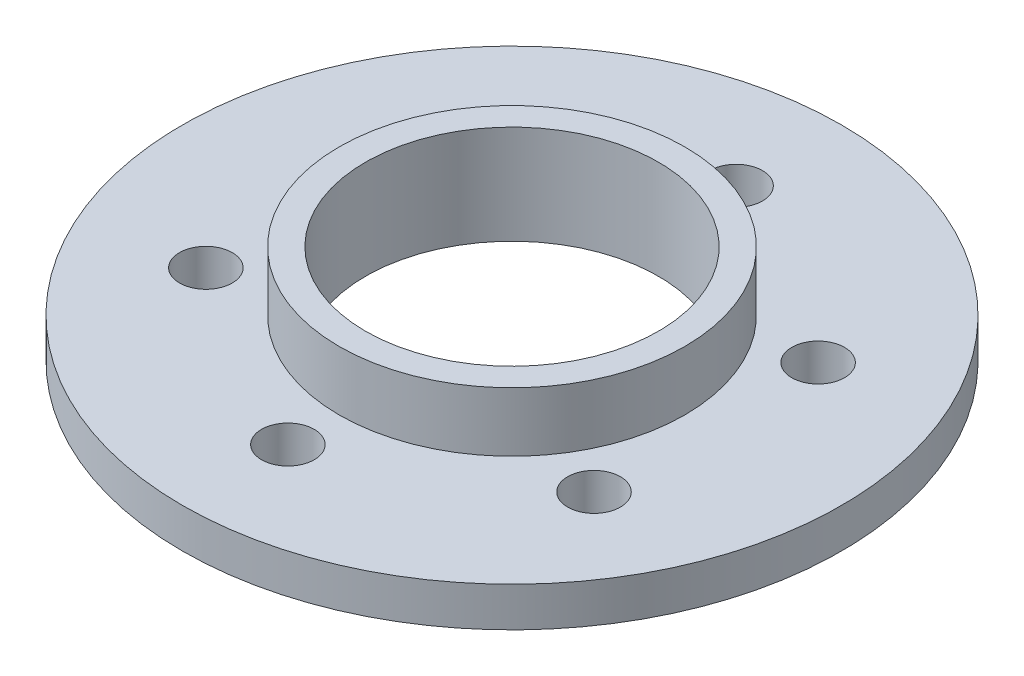
ISO-10303-21;
HEADER;
FILE_DESCRIPTION(('STEP AP214'),'2;1');
FILE_NAME('part.step','',(''),(''),'','','');
FILE_SCHEMA(('AUTOMOTIVE_DESIGN { 1 0 10303 214 1 1 1 1 }'));
ENDSEC;
DATA;
#1=APPLICATION_CONTEXT('core data for automotive mechanical design processes');
#2=APPLICATION_PROTOCOL_DEFINITION('international standard','automotive_design',2000,#1);
#3=PRODUCT_CONTEXT('',#1,'mechanical');
#4=PRODUCT('Part','Part','',(#3));
#5=PRODUCT_RELATED_PRODUCT_CATEGORY('part','',(#4));
#6=PRODUCT_DEFINITION_FORMATION('','',#4);
#7=PRODUCT_DEFINITION_CONTEXT('part definition',#1,'design');
#8=PRODUCT_DEFINITION('design','',#6,#7);
#9=PRODUCT_DEFINITION_SHAPE('','',#8);
#10=(LENGTH_UNIT() NAMED_UNIT(*) SI_UNIT(.MILLI.,.METRE.));
#11=(NAMED_UNIT(*) PLANE_ANGLE_UNIT() SI_UNIT($,.RADIAN.));
#12=(NAMED_UNIT(*) SI_UNIT($,.STERADIAN.) SOLID_ANGLE_UNIT());
#13=UNCERTAINTY_MEASURE_WITH_UNIT(LENGTH_MEASURE(1.E-05),#10,'distance_accuracy_value','');
#14=(GEOMETRIC_REPRESENTATION_CONTEXT(3) GLOBAL_UNCERTAINTY_ASSIGNED_CONTEXT((#13)) GLOBAL_UNIT_ASSIGNED_CONTEXT((#10,
#11,#12)) REPRESENTATION_CONTEXT('',''));
#15=CARTESIAN_POINT('',(0.,0.,0.));
#16=DIRECTION('',(0.,0.,1.));
#17=DIRECTION('',(1.,0.,0.));
#18=AXIS2_PLACEMENT_3D('',#15,#16,#17);
#19=CARTESIAN_POINT('',(0.,3.,0.));
#20=DIRECTION('',(0.,1.,0.));
#21=DIRECTION('',(0.,0.,1.));
#22=AXIS2_PLACEMENT_3D('',#19,#20,#21);
#23=PLANE('',#22);
#24=CARTESIAN_POINT('',(0.,3.,0.));
#25=DIRECTION('',(0.,1.,0.));
#26=DIRECTION('',(0.,0.,1.));
#27=AXIS2_PLACEMENT_3D('',#24,#25,#26);
#28=CIRCLE('',#27,13.1125);
#29=CARTESIAN_POINT('',(0.,3.,13.1125));
#30=VERTEX_POINT('',#29);
#31=EDGE_CURVE('E84',#30,#30,#28,.T.);
#32=ORIENTED_EDGE('',*,*,#31,.F.);
#33=EDGE_LOOP('',(#32));
#34=FACE_BOUND('',#33,.T.);
#35=CARTESIAN_POINT('',(0.,3.,-17.));
#36=DIRECTION('',(0.,1.,0.));
#37=DIRECTION('',(0.,0.,1.));
#38=AXIS2_PLACEMENT_3D('',#35,#36,#37);
#39=CIRCLE('',#38,2.);
#40=CARTESIAN_POINT('',(0.,3.,-15.));
#41=VERTEX_POINT('',#40);
#42=EDGE_CURVE('E73',#41,#41,#39,.T.);
#43=ORIENTED_EDGE('',*,*,#42,.F.);
#44=EDGE_LOOP('',(#43));
#45=FACE_BOUND('',#44,.T.);
#46=CARTESIAN_POINT('',(-14.7224318643355,3.,-8.49999999999999));
#47=DIRECTION('',(0.,1.,0.));
#48=DIRECTION('',(0.,0.,1.));
#49=AXIS2_PLACEMENT_3D('',#46,#47,#48);
#50=CIRCLE('',#49,2.0000000000002);
#51=CARTESIAN_POINT('',(-14.7224318643355,3.,-6.49999999999979));
#52=VERTEX_POINT('',#51);
#53=EDGE_CURVE('E74',#52,#52,#50,.T.);
#54=ORIENTED_EDGE('',*,*,#53,.F.);
#55=EDGE_LOOP('',(#54));
#56=FACE_BOUND('',#55,.T.);
#57=CARTESIAN_POINT('',(-14.7224318643355,3.,8.5));
#58=DIRECTION('',(0.,1.,0.));
#59=DIRECTION('',(0.,0.,1.));
#60=AXIS2_PLACEMENT_3D('',#57,#58,#59);
#61=CIRCLE('',#60,2.00000000000015);
#62=CARTESIAN_POINT('',(-14.7224318643355,3.,10.5000000000002));
#63=VERTEX_POINT('',#62);
#64=EDGE_CURVE('E48',#63,#63,#61,.T.);
#65=ORIENTED_EDGE('',*,*,#64,.F.);
#66=EDGE_LOOP('',(#65));
#67=FACE_BOUND('',#66,.T.);
#68=CARTESIAN_POINT('',(0.,3.,17.));
#69=DIRECTION('',(0.,1.,0.));
#70=DIRECTION('',(0.,0.,1.));
#71=AXIS2_PLACEMENT_3D('',#68,#69,#70);
#72=CIRCLE('',#71,2.00000000000012);
#73=CARTESIAN_POINT('',(0.,3.,19.0000000000001));
#74=VERTEX_POINT('',#73);
#75=EDGE_CURVE('E55',#74,#74,#72,.T.);
#76=ORIENTED_EDGE('',*,*,#75,.F.);
#77=EDGE_LOOP('',(#76));
#78=FACE_BOUND('',#77,.T.);
#79=CARTESIAN_POINT('',(14.7224318643355,3.,8.5));
#80=DIRECTION('',(0.,1.,0.));
#81=DIRECTION('',(0.,0.,1.));
#82=AXIS2_PLACEMENT_3D('',#79,#80,#81);
#83=CIRCLE('',#82,2.00000000000008);
#84=CARTESIAN_POINT('',(14.7224318643355,3.,10.5000000000001));
#85=VERTEX_POINT('',#84);
#86=EDGE_CURVE('E61',#85,#85,#83,.T.);
#87=ORIENTED_EDGE('',*,*,#86,.F.);
#88=EDGE_LOOP('',(#87));
#89=FACE_BOUND('',#88,.T.);
#90=CARTESIAN_POINT('',(14.7224318643355,3.,-8.50000000000001));
#91=DIRECTION('',(0.,1.,0.));
#92=DIRECTION('',(0.,0.,1.));
#93=AXIS2_PLACEMENT_3D('',#90,#91,#92);
#94=CIRCLE('',#93,2.00000000000004);
#95=CARTESIAN_POINT('',(14.7224318643355,3.,-6.49999999999996));
#96=VERTEX_POINT('',#95);
#97=EDGE_CURVE('E67',#96,#96,#94,.T.);
#98=ORIENTED_EDGE('',*,*,#97,.F.);
#99=EDGE_LOOP('',(#98));
#100=FACE_BOUND('',#99,.T.);
#101=CARTESIAN_POINT('',(0.,3.,0.));
#102=DIRECTION('',(0.,1.,0.));
#103=DIRECTION('',(0.,0.,1.));
#104=AXIS2_PLACEMENT_3D('',#101,#102,#103);
#105=CIRCLE('',#104,25.);
#106=CARTESIAN_POINT('',(0.,3.,25.));
#107=VERTEX_POINT('',#106);
#108=EDGE_CURVE('E10',#107,#107,#105,.T.);
#109=ORIENTED_EDGE('',*,*,#108,.T.);
#110=EDGE_LOOP('',(#109));
#111=FACE_BOUND('',#110,.T.);
#112=ADVANCED_FACE('F35',(#34,#45,#56,#67,#78,#89,#100,#111),#23,.T.);
#113=CARTESIAN_POINT('',(0.,0.,0.));
#114=DIRECTION('',(0.,1.,0.));
#115=DIRECTION('',(0.,0.,1.));
#116=AXIS2_PLACEMENT_3D('',#113,#114,#115);
#117=PLANE('',#116);
#118=CARTESIAN_POINT('',(0.,0.,0.));
#119=DIRECTION('',(0.,1.,0.));
#120=DIRECTION('',(0.,0.,1.));
#121=AXIS2_PLACEMENT_3D('',#118,#119,#120);
#122=CIRCLE('',#121,11.1125);
#123=CARTESIAN_POINT('',(0.,0.,11.1125));
#124=VERTEX_POINT('',#123);
#125=EDGE_CURVE('E92',#124,#124,#122,.T.);
#126=ORIENTED_EDGE('',*,*,#125,.T.);
#127=EDGE_LOOP('',(#126));
#128=FACE_BOUND('',#127,.T.);
#129=CARTESIAN_POINT('',(0.,0.,-17.));
#130=DIRECTION('',(0.,1.,0.));
#131=DIRECTION('',(0.,0.,1.));
#132=AXIS2_PLACEMENT_3D('',#129,#130,#131);
#133=CIRCLE('',#132,2.);
#134=CARTESIAN_POINT('',(0.,0.,-15.));
#135=VERTEX_POINT('',#134);
#136=EDGE_CURVE('E46',#135,#135,#133,.T.);
#137=ORIENTED_EDGE('',*,*,#136,.T.);
#138=EDGE_LOOP('',(#137));
#139=FACE_BOUND('',#138,.T.);
#140=CARTESIAN_POINT('',(-14.7224318643355,0.,-8.49999999999999));
#141=DIRECTION('',(0.,1.,0.));
#142=DIRECTION('',(0.,0.,1.));
#143=AXIS2_PLACEMENT_3D('',#140,#141,#142);
#144=CIRCLE('',#143,2.0000000000002);
#145=CARTESIAN_POINT('',(-14.7224318643355,0.,-6.49999999999979));
#146=VERTEX_POINT('',#145);
#147=EDGE_CURVE('E52',#146,#146,#144,.T.);
#148=ORIENTED_EDGE('',*,*,#147,.T.);
#149=EDGE_LOOP('',(#148));
#150=FACE_BOUND('',#149,.T.);
#151=CARTESIAN_POINT('',(-14.7224318643355,0.,8.5));
#152=DIRECTION('',(0.,1.,0.));
#153=DIRECTION('',(0.,0.,1.));
#154=AXIS2_PLACEMENT_3D('',#151,#152,#153);
#155=CIRCLE('',#154,2.00000000000015);
#156=CARTESIAN_POINT('',(-14.7224318643355,0.,10.5000000000002));
#157=VERTEX_POINT('',#156);
#158=EDGE_CURVE('E51',#157,#157,#155,.T.);
#159=ORIENTED_EDGE('',*,*,#158,.T.);
#160=EDGE_LOOP('',(#159));
#161=FACE_BOUND('',#160,.T.);
#162=CARTESIAN_POINT('',(0.,0.,17.));
#163=DIRECTION('',(0.,1.,0.));
#164=DIRECTION('',(0.,0.,1.));
#165=AXIS2_PLACEMENT_3D('',#162,#163,#164);
#166=CIRCLE('',#165,2.00000000000012);
#167=CARTESIAN_POINT('',(0.,0.,19.0000000000001));
#168=VERTEX_POINT('',#167);
#169=EDGE_CURVE('E58',#168,#168,#166,.T.);
#170=ORIENTED_EDGE('',*,*,#169,.T.);
#171=EDGE_LOOP('',(#170));
#172=FACE_BOUND('',#171,.T.);
#173=CARTESIAN_POINT('',(14.7224318643355,0.,8.5));
#174=DIRECTION('',(0.,1.,0.));
#175=DIRECTION('',(0.,0.,1.));
#176=AXIS2_PLACEMENT_3D('',#173,#174,#175);
#177=CIRCLE('',#176,2.00000000000008);
#178=CARTESIAN_POINT('',(14.7224318643355,0.,10.5000000000001));
#179=VERTEX_POINT('',#178);
#180=EDGE_CURVE('E64',#179,#179,#177,.T.);
#181=ORIENTED_EDGE('',*,*,#180,.T.);
#182=EDGE_LOOP('',(#181));
#183=FACE_BOUND('',#182,.T.);
#184=CARTESIAN_POINT('',(14.7224318643355,0.,-8.50000000000001));
#185=DIRECTION('',(0.,1.,0.));
#186=DIRECTION('',(0.,0.,1.));
#187=AXIS2_PLACEMENT_3D('',#184,#185,#186);
#188=CIRCLE('',#187,2.00000000000004);
#189=CARTESIAN_POINT('',(14.7224318643355,0.,-6.49999999999996));
#190=VERTEX_POINT('',#189);
#191=EDGE_CURVE('E70',#190,#190,#188,.T.);
#192=ORIENTED_EDGE('',*,*,#191,.T.);
#193=EDGE_LOOP('',(#192));
#194=FACE_BOUND('',#193,.T.);
#195=CARTESIAN_POINT('',(0.,0.,0.));
#196=DIRECTION('',(0.,1.,0.));
#197=DIRECTION('',(0.,0.,1.));
#198=AXIS2_PLACEMENT_3D('',#195,#196,#197);
#199=CIRCLE('',#198,25.);
#200=CARTESIAN_POINT('',(0.,0.,25.));
#201=VERTEX_POINT('',#200);
#202=EDGE_CURVE('E39',#201,#201,#199,.T.);
#203=ORIENTED_EDGE('',*,*,#202,.F.);
#204=EDGE_LOOP('',(#203));
#205=FACE_BOUND('',#204,.T.);
#206=ADVANCED_FACE('F96',(#128,#139,#150,#161,#172,#183,#194,#205),#117,.F.);
#207=CARTESIAN_POINT('',(0.,3.,0.));
#208=DIRECTION('',(0.,-1.,0.));
#209=DIRECTION('',(0.,0.,-1.));
#210=AXIS2_PLACEMENT_3D('',#207,#208,#209);
#211=CYLINDRICAL_SURFACE('',#210,25.);
#212=ORIENTED_EDGE('',*,*,#108,.F.);
#213=EDGE_LOOP('',(#212));
#214=FACE_BOUND('',#213,.T.);
#215=ORIENTED_EDGE('',*,*,#202,.T.);
#216=EDGE_LOOP('',(#215));
#217=FACE_BOUND('',#216,.T.);
#218=ADVANCED_FACE('F37',(#214,#217),#211,.T.);
#219=CARTESIAN_POINT('',(14.7224318643355,0.,-8.50000000000001));
#220=DIRECTION('',(0.,1.,0.));
#221=DIRECTION('',(0.,0.,1.));
#222=AXIS2_PLACEMENT_3D('',#219,#220,#221);
#223=CYLINDRICAL_SURFACE('',#222,2.00000000000004);
#224=ORIENTED_EDGE('',*,*,#191,.F.);
#225=EDGE_LOOP('',(#224));
#226=FACE_BOUND('',#225,.T.);
#227=ORIENTED_EDGE('',*,*,#97,.T.);
#228=EDGE_LOOP('',(#227));
#229=FACE_BOUND('',#228,.T.);
#230=ADVANCED_FACE('F132',(#226,#229),#223,.F.);
#231=CARTESIAN_POINT('',(14.7224318643355,0.,8.5));
#232=DIRECTION('',(0.,1.,0.));
#233=DIRECTION('',(0.,0.,1.));
#234=AXIS2_PLACEMENT_3D('',#231,#232,#233);
#235=CYLINDRICAL_SURFACE('',#234,2.00000000000008);
#236=ORIENTED_EDGE('',*,*,#180,.F.);
#237=EDGE_LOOP('',(#236));
#238=FACE_BOUND('',#237,.T.);
#239=ORIENTED_EDGE('',*,*,#86,.T.);
#240=EDGE_LOOP('',(#239));
#241=FACE_BOUND('',#240,.T.);
#242=ADVANCED_FACE('F128',(#238,#241),#235,.F.);
#243=CARTESIAN_POINT('',(0.,0.,17.));
#244=DIRECTION('',(0.,1.,0.));
#245=DIRECTION('',(0.,0.,1.));
#246=AXIS2_PLACEMENT_3D('',#243,#244,#245);
#247=CYLINDRICAL_SURFACE('',#246,2.00000000000012);
#248=ORIENTED_EDGE('',*,*,#169,.F.);
#249=EDGE_LOOP('',(#248));
#250=FACE_BOUND('',#249,.T.);
#251=ORIENTED_EDGE('',*,*,#75,.T.);
#252=EDGE_LOOP('',(#251));
#253=FACE_BOUND('',#252,.T.);
#254=ADVANCED_FACE('F124',(#250,#253),#247,.F.);
#255=CARTESIAN_POINT('',(-14.7224318643355,0.,8.5));
#256=DIRECTION('',(0.,1.,0.));
#257=DIRECTION('',(0.,0.,1.));
#258=AXIS2_PLACEMENT_3D('',#255,#256,#257);
#259=CYLINDRICAL_SURFACE('',#258,2.00000000000015);
#260=ORIENTED_EDGE('',*,*,#158,.F.);
#261=EDGE_LOOP('',(#260));
#262=FACE_BOUND('',#261,.T.);
#263=ORIENTED_EDGE('',*,*,#64,.T.);
#264=EDGE_LOOP('',(#263));
#265=FACE_BOUND('',#264,.T.);
#266=ADVANCED_FACE('F120',(#262,#265),#259,.F.);
#267=CARTESIAN_POINT('',(-14.7224318643355,0.,-8.49999999999999));
#268=DIRECTION('',(0.,1.,0.));
#269=DIRECTION('',(0.,0.,1.));
#270=AXIS2_PLACEMENT_3D('',#267,#268,#269);
#271=CYLINDRICAL_SURFACE('',#270,2.0000000000002);
#272=ORIENTED_EDGE('',*,*,#147,.F.);
#273=EDGE_LOOP('',(#272));
#274=FACE_BOUND('',#273,.T.);
#275=ORIENTED_EDGE('',*,*,#53,.T.);
#276=EDGE_LOOP('',(#275));
#277=FACE_BOUND('',#276,.T.);
#278=ADVANCED_FACE('F123',(#274,#277),#271,.F.);
#279=CARTESIAN_POINT('',(0.,0.,-17.));
#280=DIRECTION('',(0.,1.,0.));
#281=DIRECTION('',(0.,0.,1.));
#282=AXIS2_PLACEMENT_3D('',#279,#280,#281);
#283=CYLINDRICAL_SURFACE('',#282,2.);
#284=ORIENTED_EDGE('',*,*,#136,.F.);
#285=EDGE_LOOP('',(#284));
#286=FACE_BOUND('',#285,.T.);
#287=ORIENTED_EDGE('',*,*,#42,.T.);
#288=EDGE_LOOP('',(#287));
#289=FACE_BOUND('',#288,.T.);
#290=ADVANCED_FACE('F139',(#286,#289),#283,.F.);
#291=CARTESIAN_POINT('',(0.,7.5,0.));
#292=DIRECTION('',(0.,1.,0.));
#293=DIRECTION('',(0.,0.,1.));
#294=AXIS2_PLACEMENT_3D('',#291,#292,#293);
#295=PLANE('',#294);
#296=CARTESIAN_POINT('',(0.,7.5,0.));
#297=DIRECTION('',(0.,1.,0.));
#298=DIRECTION('',(0.,0.,1.));
#299=AXIS2_PLACEMENT_3D('',#296,#297,#298);
#300=CIRCLE('',#299,13.1125);
#301=CARTESIAN_POINT('',(0.,7.5,13.1125));
#302=VERTEX_POINT('',#301);
#303=EDGE_CURVE('E77',#302,#302,#300,.T.);
#304=ORIENTED_EDGE('',*,*,#303,.T.);
#305=EDGE_LOOP('',(#304));
#306=FACE_BOUND('',#305,.T.);
#307=CARTESIAN_POINT('',(0.,7.5,0.));
#308=DIRECTION('',(0.,1.,0.));
#309=DIRECTION('',(0.,0.,1.));
#310=AXIS2_PLACEMENT_3D('',#307,#308,#309);
#311=CIRCLE('',#310,11.1125);
#312=CARTESIAN_POINT('',(0.,7.5,11.1125));
#313=VERTEX_POINT('',#312);
#314=EDGE_CURVE('E87',#313,#313,#311,.T.);
#315=ORIENTED_EDGE('',*,*,#314,.F.);
#316=EDGE_LOOP('',(#315));
#317=FACE_BOUND('',#316,.T.);
#318=ADVANCED_FACE('F107',(#306,#317),#295,.T.);
#319=CARTESIAN_POINT('',(0.,7.5,0.));
#320=DIRECTION('',(0.,-1.,0.));
#321=DIRECTION('',(0.,0.,-1.));
#322=AXIS2_PLACEMENT_3D('',#319,#320,#321);
#323=CYLINDRICAL_SURFACE('',#322,13.1125);
#324=ORIENTED_EDGE('',*,*,#303,.F.);
#325=EDGE_LOOP('',(#324));
#326=FACE_BOUND('',#325,.T.);
#327=ORIENTED_EDGE('',*,*,#31,.T.);
#328=EDGE_LOOP('',(#327));
#329=FACE_BOUND('',#328,.T.);
#330=ADVANCED_FACE('F101',(#326,#329),#323,.T.);
#331=CARTESIAN_POINT('',(0.,7.5,0.));
#332=DIRECTION('',(0.,-1.,0.));
#333=DIRECTION('',(0.,0.,-1.));
#334=AXIS2_PLACEMENT_3D('',#331,#332,#333);
#335=CYLINDRICAL_SURFACE('',#334,11.1125);
#336=ORIENTED_EDGE('',*,*,#314,.T.);
#337=EDGE_LOOP('',(#336));
#338=FACE_BOUND('',#337,.T.);
#339=ORIENTED_EDGE('',*,*,#125,.F.);
#340=EDGE_LOOP('',(#339));
#341=FACE_BOUND('',#340,.T.);
#342=ADVANCED_FACE('F99',(#338,#341),#335,.F.);
#343=CLOSED_SHELL('',(#112,#206,#218,#230,#242,#254,#266,#278,#290,#318,#330,#342));
#344=MANIFOLD_SOLID_BREP('B2',#343);
#345=ADVANCED_BREP_SHAPE_REPRESENTATION('',(#18,#344),#14);
#346=SHAPE_DEFINITION_REPRESENTATION(#9,#345);
ENDSEC;
END-ISO-10303-21;
